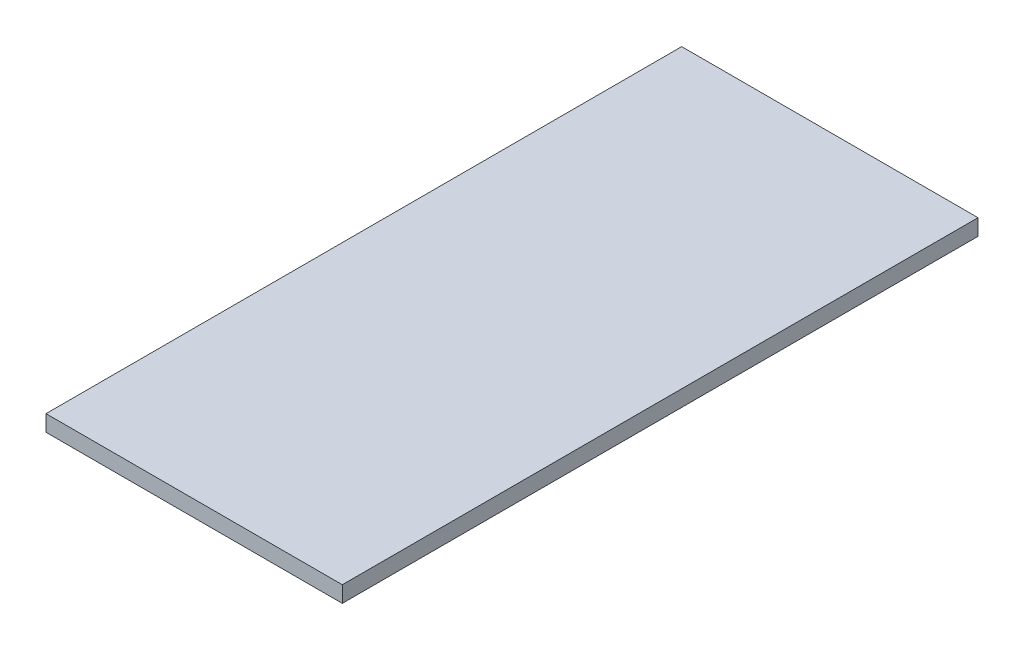
ISO-10303-21;
HEADER;
FILE_DESCRIPTION(('STEP AP214'),'2;1');
FILE_NAME('part.step','',(''),(''),'','','');
FILE_SCHEMA(('AUTOMOTIVE_DESIGN { 1 0 10303 214 1 1 1 1 }'));
ENDSEC;
DATA;
#1=APPLICATION_CONTEXT('core data for automotive mechanical design processes');
#2=APPLICATION_PROTOCOL_DEFINITION('international standard','automotive_design',2000,#1);
#3=PRODUCT_CONTEXT('',#1,'mechanical');
#4=PRODUCT('Part','Part','',(#3));
#5=PRODUCT_RELATED_PRODUCT_CATEGORY('part','',(#4));
#6=PRODUCT_DEFINITION_FORMATION('','',#4);
#7=PRODUCT_DEFINITION_CONTEXT('part definition',#1,'design');
#8=PRODUCT_DEFINITION('design','',#6,#7);
#9=PRODUCT_DEFINITION_SHAPE('','',#8);
#10=(LENGTH_UNIT() NAMED_UNIT(*) SI_UNIT(.MILLI.,.METRE.));
#11=(NAMED_UNIT(*) PLANE_ANGLE_UNIT() SI_UNIT($,.RADIAN.));
#12=(NAMED_UNIT(*) SI_UNIT($,.STERADIAN.) SOLID_ANGLE_UNIT());
#13=UNCERTAINTY_MEASURE_WITH_UNIT(LENGTH_MEASURE(1.E-05),#10,'distance_accuracy_value','');
#14=(GEOMETRIC_REPRESENTATION_CONTEXT(3) GLOBAL_UNCERTAINTY_ASSIGNED_CONTEXT((#13)) GLOBAL_UNIT_ASSIGNED_CONTEXT((#10,
#11,#12)) REPRESENTATION_CONTEXT('',''));
#15=CARTESIAN_POINT('',(0.,0.,0.));
#16=DIRECTION('',(0.,0.,1.));
#17=DIRECTION('',(1.,0.,0.));
#18=AXIS2_PLACEMENT_3D('',#15,#16,#17);
#19=CARTESIAN_POINT('',(27.5,3.,59.));
#20=DIRECTION('',(-1.,0.,0.));
#21=DIRECTION('',(0.,0.,1.));
#22=AXIS2_PLACEMENT_3D('',#19,#20,#21);
#23=PLANE('',#22);
#24=DIRECTION('',(0.,0.,-1.));
#25=VECTOR('',#24,1.);
#26=CARTESIAN_POINT('',(27.5,0.,59.));
#27=LINE('',#26,#25);
#28=CARTESIAN_POINT('',(27.5,0.,59.));
#29=VERTEX_POINT('',#28);
#30=CARTESIAN_POINT('',(27.5,0.,-59.));
#31=VERTEX_POINT('',#30);
#32=EDGE_CURVE('E98',#29,#31,#27,.T.);
#33=ORIENTED_EDGE('',*,*,#32,.T.);
#34=DIRECTION('',(0.,-1.,0.));
#35=VECTOR('',#34,1.);
#36=CARTESIAN_POINT('',(27.5,3.,-59.));
#37=LINE('',#36,#35);
#38=CARTESIAN_POINT('',(27.5,3.,-59.));
#39=VERTEX_POINT('',#38);
#40=EDGE_CURVE('E11',#39,#31,#37,.T.);
#41=ORIENTED_EDGE('',*,*,#40,.F.);
#42=DIRECTION('',(0.,0.,-1.));
#43=VECTOR('',#42,1.);
#44=CARTESIAN_POINT('',(27.5,3.,59.));
#45=LINE('',#44,#43);
#46=CARTESIAN_POINT('',(27.5,3.,59.));
#47=VERTEX_POINT('',#46);
#48=EDGE_CURVE('E86',#47,#39,#45,.T.);
#49=ORIENTED_EDGE('',*,*,#48,.F.);
#50=DIRECTION('',(0.,-1.,0.));
#51=VECTOR('',#50,1.);
#52=CARTESIAN_POINT('',(27.5,3.,59.));
#53=LINE('',#52,#51);
#54=EDGE_CURVE('E94',#47,#29,#53,.T.);
#55=ORIENTED_EDGE('',*,*,#54,.T.);
#56=EDGE_LOOP('',(#33,#41,#49,#55));
#57=FACE_BOUND('',#56,.T.);
#58=ADVANCED_FACE('F35',(#57),#23,.F.);
#59=CARTESIAN_POINT('',(-27.5,3.,-59.));
#60=DIRECTION('',(0.,0.,1.));
#61=DIRECTION('',(1.,0.,0.));
#62=AXIS2_PLACEMENT_3D('',#59,#60,#61);
#63=PLANE('',#62);
#64=DIRECTION('',(-1.,0.,0.));
#65=VECTOR('',#64,1.);
#66=CARTESIAN_POINT('',(-27.5,0.,-59.));
#67=LINE('',#66,#65);
#68=CARTESIAN_POINT('',(-27.5,0.,-59.));
#69=VERTEX_POINT('',#68);
#70=EDGE_CURVE('E90',#31,#69,#67,.T.);
#71=ORIENTED_EDGE('',*,*,#70,.T.);
#72=DIRECTION('',(0.,-1.,0.));
#73=VECTOR('',#72,1.);
#74=CARTESIAN_POINT('',(-27.5,3.,-59.));
#75=LINE('',#74,#73);
#76=CARTESIAN_POINT('',(-27.5,3.,-59.));
#77=VERTEX_POINT('',#76);
#78=EDGE_CURVE('E43',#77,#69,#75,.T.);
#79=ORIENTED_EDGE('',*,*,#78,.F.);
#80=DIRECTION('',(-1.,0.,0.));
#81=VECTOR('',#80,1.);
#82=CARTESIAN_POINT('',(-27.5,3.,-59.));
#83=LINE('',#82,#81);
#84=EDGE_CURVE('E81',#39,#77,#83,.T.);
#85=ORIENTED_EDGE('',*,*,#84,.F.);
#86=ORIENTED_EDGE('',*,*,#40,.T.);
#87=EDGE_LOOP('',(#71,#79,#85,#86));
#88=FACE_BOUND('',#87,.T.);
#89=ADVANCED_FACE('F89',(#88),#63,.F.);
#90=CARTESIAN_POINT('',(-27.5,3.,59.));
#91=DIRECTION('',(1.,0.,0.));
#92=DIRECTION('',(0.,0.,-1.));
#93=AXIS2_PLACEMENT_3D('',#90,#91,#92);
#94=PLANE('',#93);
#95=DIRECTION('',(0.,0.,1.));
#96=VECTOR('',#95,1.);
#97=CARTESIAN_POINT('',(-27.5,0.,59.));
#98=LINE('',#97,#96);
#99=CARTESIAN_POINT('',(-27.5,0.,59.));
#100=VERTEX_POINT('',#99);
#101=EDGE_CURVE('E68',#69,#100,#98,.T.);
#102=ORIENTED_EDGE('',*,*,#101,.T.);
#103=DIRECTION('',(0.,-1.,0.));
#104=VECTOR('',#103,1.);
#105=CARTESIAN_POINT('',(-27.5,3.,59.));
#106=LINE('',#105,#104);
#107=CARTESIAN_POINT('',(-27.5,3.,59.));
#108=VERTEX_POINT('',#107);
#109=EDGE_CURVE('E91',#108,#100,#106,.T.);
#110=ORIENTED_EDGE('',*,*,#109,.F.);
#111=DIRECTION('',(0.,0.,1.));
#112=VECTOR('',#111,1.);
#113=CARTESIAN_POINT('',(-27.5,3.,59.));
#114=LINE('',#113,#112);
#115=EDGE_CURVE('E84',#77,#108,#114,.T.);
#116=ORIENTED_EDGE('',*,*,#115,.F.);
#117=ORIENTED_EDGE('',*,*,#78,.T.);
#118=EDGE_LOOP('',(#102,#110,#116,#117));
#119=FACE_BOUND('',#118,.T.);
#120=ADVANCED_FACE('F92',(#119),#94,.F.);
#121=CARTESIAN_POINT('',(-27.5,3.,59.));
#122=DIRECTION('',(0.,0.,-1.));
#123=DIRECTION('',(-1.,0.,0.));
#124=AXIS2_PLACEMENT_3D('',#121,#122,#123);
#125=PLANE('',#124);
#126=DIRECTION('',(1.,0.,0.));
#127=VECTOR('',#126,1.);
#128=CARTESIAN_POINT('',(-27.5,0.,59.));
#129=LINE('',#128,#127);
#130=EDGE_CURVE('E74',#100,#29,#129,.T.);
#131=ORIENTED_EDGE('',*,*,#130,.T.);
#132=ORIENTED_EDGE('',*,*,#54,.F.);
#133=DIRECTION('',(1.,0.,0.));
#134=VECTOR('',#133,1.);
#135=CARTESIAN_POINT('',(-27.5,3.,59.));
#136=LINE('',#135,#134);
#137=EDGE_CURVE('E51',#108,#47,#136,.T.);
#138=ORIENTED_EDGE('',*,*,#137,.F.);
#139=ORIENTED_EDGE('',*,*,#109,.T.);
#140=EDGE_LOOP('',(#131,#132,#138,#139));
#141=FACE_BOUND('',#140,.T.);
#142=ADVANCED_FACE('F105',(#141),#125,.F.);
#143=CARTESIAN_POINT('',(0.,3.,0.));
#144=DIRECTION('',(0.,-1.,0.));
#145=DIRECTION('',(0.,0.,-1.));
#146=AXIS2_PLACEMENT_3D('',#143,#144,#145);
#147=PLANE('',#146);
#148=ORIENTED_EDGE('',*,*,#48,.T.);
#149=ORIENTED_EDGE('',*,*,#84,.T.);
#150=ORIENTED_EDGE('',*,*,#115,.T.);
#151=ORIENTED_EDGE('',*,*,#137,.T.);
#152=EDGE_LOOP('',(#148,#149,#150,#151));
#153=FACE_BOUND('',#152,.T.);
#154=ADVANCED_FACE('F82',(#153),#147,.F.);
#155=CARTESIAN_POINT('',(0.,0.,0.));
#156=DIRECTION('',(0.,-1.,0.));
#157=DIRECTION('',(0.,0.,-1.));
#158=AXIS2_PLACEMENT_3D('',#155,#156,#157);
#159=PLANE('',#158);
#160=ORIENTED_EDGE('',*,*,#32,.F.);
#161=ORIENTED_EDGE('',*,*,#130,.F.);
#162=ORIENTED_EDGE('',*,*,#101,.F.);
#163=ORIENTED_EDGE('',*,*,#70,.F.);
#164=EDGE_LOOP('',(#160,#161,#162,#163));
#165=FACE_BOUND('',#164,.T.);
#166=ADVANCED_FACE('F108',(#165),#159,.T.);
#167=CLOSED_SHELL('',(#58,#89,#120,#142,#154,#166));
#168=MANIFOLD_SOLID_BREP('B2',#167);
#169=ADVANCED_BREP_SHAPE_REPRESENTATION('',(#18,#168),#14);
#170=SHAPE_DEFINITION_REPRESENTATION(#9,#169);
ENDSEC;
END-ISO-10303-21;
